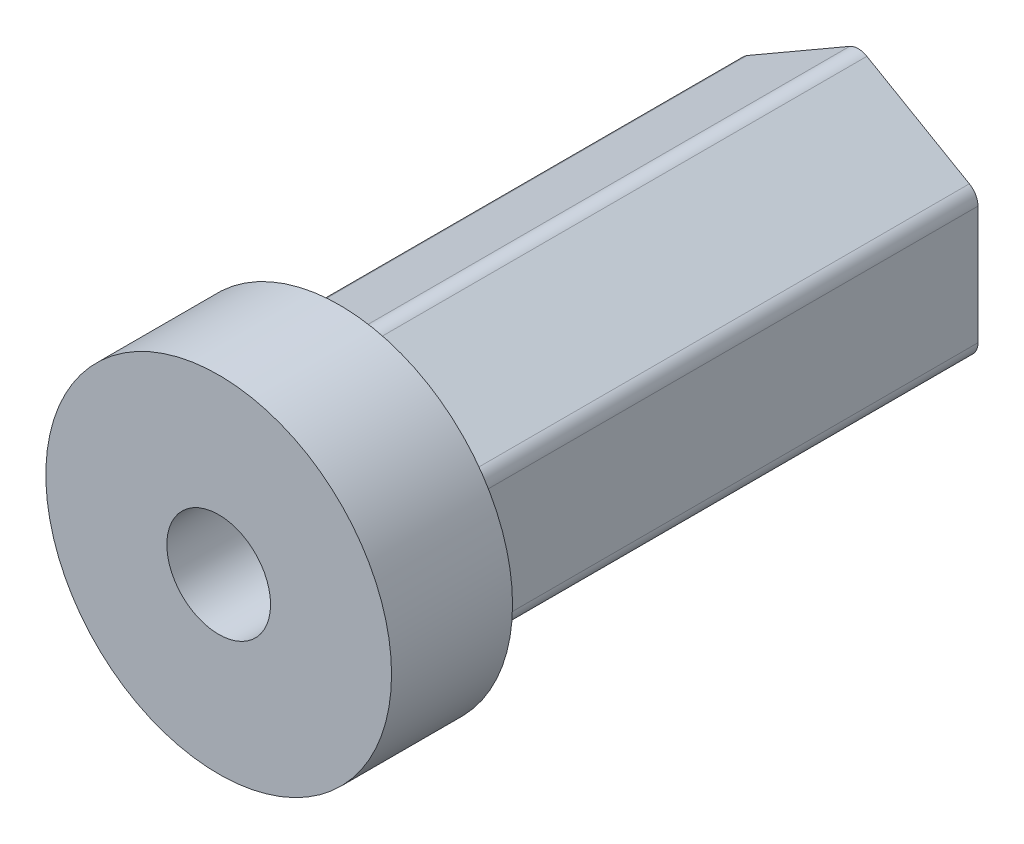
ISO-10303-21;
HEADER;
FILE_DESCRIPTION(('STEP AP214'),'2;1');
FILE_NAME('part.step','',(''),(''),'','','');
FILE_SCHEMA(('AUTOMOTIVE_DESIGN { 1 0 10303 214 1 1 1 1 }'));
ENDSEC;
DATA;
#1=APPLICATION_CONTEXT('core data for automotive mechanical design processes');
#2=APPLICATION_PROTOCOL_DEFINITION('international standard','automotive_design',2000,#1);
#3=PRODUCT_CONTEXT('',#1,'mechanical');
#4=PRODUCT('Part','Part','',(#3));
#5=PRODUCT_RELATED_PRODUCT_CATEGORY('part','',(#4));
#6=PRODUCT_DEFINITION_FORMATION('','',#4);
#7=PRODUCT_DEFINITION_CONTEXT('part definition',#1,'design');
#8=PRODUCT_DEFINITION('design','',#6,#7);
#9=PRODUCT_DEFINITION_SHAPE('','',#8);
#10=(LENGTH_UNIT() NAMED_UNIT(*) SI_UNIT(.MILLI.,.METRE.));
#11=(NAMED_UNIT(*) PLANE_ANGLE_UNIT() SI_UNIT($,.RADIAN.));
#12=(NAMED_UNIT(*) SI_UNIT($,.STERADIAN.) SOLID_ANGLE_UNIT());
#13=UNCERTAINTY_MEASURE_WITH_UNIT(LENGTH_MEASURE(1.E-05),#10,'distance_accuracy_value','');
#14=(GEOMETRIC_REPRESENTATION_CONTEXT(3) GLOBAL_UNCERTAINTY_ASSIGNED_CONTEXT((#13)) GLOBAL_UNIT_ASSIGNED_CONTEXT((#10,
#11,#12)) REPRESENTATION_CONTEXT('',''));
#15=CARTESIAN_POINT('',(0.,0.,0.));
#16=DIRECTION('',(0.,0.,1.));
#17=DIRECTION('',(1.,0.,0.));
#18=AXIS2_PLACEMENT_3D('',#15,#16,#17);
#19=CARTESIAN_POINT('',(0.,3.,-25.));
#20=DIRECTION('',(0.,0.,1.));
#21=DIRECTION('',(1.,0.,0.));
#22=AXIS2_PLACEMENT_3D('',#19,#20,#21);
#23=PLANE('',#22);
#24=CARTESIAN_POINT('',(0.,0.,-25.));
#25=DIRECTION('',(0.,0.,1.));
#26=DIRECTION('',(1.,0.,0.));
#27=AXIS2_PLACEMENT_3D('',#24,#25,#26);
#28=CIRCLE('',#27,3.);
#29=CARTESIAN_POINT('',(3.,0.,-25.));
#30=VERTEX_POINT('',#29);
#31=EDGE_CURVE('E177',#30,#30,#28,.T.);
#32=ORIENTED_EDGE('',*,*,#31,.T.);
#33=EDGE_LOOP('',(#32));
#34=FACE_BOUND('',#33,.T.);
#35=DIRECTION('',(0.,1.,0.));
#36=VECTOR('',#35,1.);
#37=CARTESIAN_POINT('',(-6.92820323027551,0.,-25.));
#38=LINE('',#37,#36);
#39=CARTESIAN_POINT('',(-6.92820323027551,-3.42264973081037,-25.));
#40=VERTEX_POINT('',#39);
#41=CARTESIAN_POINT('',(-6.9282032302755,3.42264973081038,-25.));
#42=VERTEX_POINT('',#41);
#43=EDGE_CURVE('E148',#40,#42,#38,.T.);
#44=ORIENTED_EDGE('',*,*,#43,.T.);
#45=CARTESIAN_POINT('',(-5.9282032302755,3.42264973081038,-25.));
#46=DIRECTION('',(0.,0.,1.));
#47=DIRECTION('',(1.,0.,0.));
#48=AXIS2_PLACEMENT_3D('',#45,#46,#47);
#49=CIRCLE('',#48,1.);
#50=CARTESIAN_POINT('',(-6.4282032302755,4.28867513459482,-25.));
#51=VERTEX_POINT('',#50);
#52=EDGE_CURVE('E155',#42,#51,#49,.F.);
#53=ORIENTED_EDGE('',*,*,#52,.T.);
#54=DIRECTION('',(0.86602540378444,0.499999999999998,0.));
#55=VECTOR('',#54,1.);
#56=CARTESIAN_POINT('',(-3.46410161513774,6.,-25.));
#57=LINE('',#56,#55);
#58=CARTESIAN_POINT('',(-0.499999999999981,7.71132486540519,-25.));
#59=VERTEX_POINT('',#58);
#60=EDGE_CURVE('E313',#51,#59,#57,.T.);
#61=ORIENTED_EDGE('',*,*,#60,.T.);
#62=CARTESIAN_POINT('',(0.,6.84529946162075,-25.));
#63=DIRECTION('',(0.,0.,1.));
#64=DIRECTION('',(1.,0.,0.));
#65=AXIS2_PLACEMENT_3D('',#62,#63,#64);
#66=CIRCLE('',#65,1.);
#67=CARTESIAN_POINT('',(0.500000000000017,7.71132486540518,-25.));
#68=VERTEX_POINT('',#67);
#69=EDGE_CURVE('E174',#59,#68,#66,.F.);
#70=ORIENTED_EDGE('',*,*,#69,.T.);
#71=DIRECTION('',(0.866025403784438,-0.500000000000002,0.));
#72=VECTOR('',#71,1.);
#73=CARTESIAN_POINT('',(3.46410161513777,5.99999999999999,-25.));
#74=LINE('',#73,#72);
#75=CARTESIAN_POINT('',(6.42820323027551,4.2886751345948,-25.));
#76=VERTEX_POINT('',#75);
#77=EDGE_CURVE('E232',#68,#76,#74,.T.);
#78=ORIENTED_EDGE('',*,*,#77,.T.);
#79=CARTESIAN_POINT('',(5.92820323027551,3.42264973081036,-25.));
#80=DIRECTION('',(0.,0.,1.));
#81=DIRECTION('',(1.,0.,0.));
#82=AXIS2_PLACEMENT_3D('',#79,#80,#81);
#83=CIRCLE('',#82,1.);
#84=CARTESIAN_POINT('',(6.92820323027551,3.42264973081036,-25.));
#85=VERTEX_POINT('',#84);
#86=EDGE_CURVE('E182',#76,#85,#83,.F.);
#87=ORIENTED_EDGE('',*,*,#86,.T.);
#88=DIRECTION('',(0.,-1.,0.));
#89=VECTOR('',#88,1.);
#90=CARTESIAN_POINT('',(6.92820323027551,0.,-25.));
#91=LINE('',#90,#89);
#92=CARTESIAN_POINT('',(6.9282032302755,-3.42264973081039,-25.));
#93=VERTEX_POINT('',#92);
#94=EDGE_CURVE('E233',#85,#93,#91,.T.);
#95=ORIENTED_EDGE('',*,*,#94,.T.);
#96=CARTESIAN_POINT('',(5.9282032302755,-3.42264973081039,-25.));
#97=DIRECTION('',(0.,0.,1.));
#98=DIRECTION('',(1.,0.,0.));
#99=AXIS2_PLACEMENT_3D('',#96,#97,#98);
#100=CIRCLE('',#99,1.);
#101=CARTESIAN_POINT('',(6.4282032302755,-4.28867513459483,-25.));
#102=VERTEX_POINT('',#101);
#103=EDGE_CURVE('E184',#93,#102,#100,.F.);
#104=ORIENTED_EDGE('',*,*,#103,.T.);
#105=DIRECTION('',(-0.86602540378444,-0.499999999999998,0.));
#106=VECTOR('',#105,1.);
#107=CARTESIAN_POINT('',(3.46410161513774,-6.00000000000001,-25.));
#108=LINE('',#107,#106);
#109=CARTESIAN_POINT('',(0.499999999999984,-7.71132486540519,-25.));
#110=VERTEX_POINT('',#109);
#111=EDGE_CURVE('E238',#102,#110,#108,.T.);
#112=ORIENTED_EDGE('',*,*,#111,.T.);
#113=CARTESIAN_POINT('',(0.,-6.84529946162075,-25.));
#114=DIRECTION('',(0.,0.,1.));
#115=DIRECTION('',(1.,0.,0.));
#116=AXIS2_PLACEMENT_3D('',#113,#114,#115);
#117=CIRCLE('',#116,1.);
#118=CARTESIAN_POINT('',(-0.500000000000015,-7.71132486540519,-25.));
#119=VERTEX_POINT('',#118);
#120=EDGE_CURVE('E156',#110,#119,#117,.F.);
#121=ORIENTED_EDGE('',*,*,#120,.T.);
#122=DIRECTION('',(-0.866025403784438,0.500000000000001,0.));
#123=VECTOR('',#122,1.);
#124=CARTESIAN_POINT('',(-3.46410161513777,-6.,-25.));
#125=LINE('',#124,#123);
#126=CARTESIAN_POINT('',(-6.42820323027551,-4.2886751345948,-25.));
#127=VERTEX_POINT('',#126);
#128=EDGE_CURVE('E150',#119,#127,#125,.T.);
#129=ORIENTED_EDGE('',*,*,#128,.T.);
#130=CARTESIAN_POINT('',(-5.92820323027551,-3.42264973081037,-25.));
#131=DIRECTION('',(0.,0.,1.));
#132=DIRECTION('',(1.,0.,0.));
#133=AXIS2_PLACEMENT_3D('',#130,#131,#132);
#134=CIRCLE('',#133,1.);
#135=EDGE_CURVE('E146',#127,#40,#134,.F.);
#136=ORIENTED_EDGE('',*,*,#135,.T.);
#137=EDGE_LOOP('',(#44,#53,#61,#70,#78,#87,#95,#104,#112,#121,#129,#136));
#138=FACE_BOUND('',#137,.T.);
#139=ADVANCED_FACE('F57',(#34,#138),#23,.F.);
#140=CARTESIAN_POINT('',(0.,10.,12.));
#141=DIRECTION('',(0.,0.,-1.));
#142=DIRECTION('',(-1.,0.,0.));
#143=AXIS2_PLACEMENT_3D('',#140,#141,#142);
#144=PLANE('',#143);
#145=CARTESIAN_POINT('',(0.,0.,12.));
#146=DIRECTION('',(0.,0.,1.));
#147=DIRECTION('',(1.,0.,0.));
#148=AXIS2_PLACEMENT_3D('',#145,#146,#147);
#149=CIRCLE('',#148,3.);
#150=CARTESIAN_POINT('',(3.,0.,12.));
#151=VERTEX_POINT('',#150);
#152=EDGE_CURVE('E172',#151,#151,#149,.T.);
#153=ORIENTED_EDGE('',*,*,#152,.F.);
#154=EDGE_LOOP('',(#153));
#155=FACE_BOUND('',#154,.T.);
#156=CARTESIAN_POINT('',(0.,0.,12.));
#157=DIRECTION('',(0.,0.,1.));
#158=DIRECTION('',(1.,0.,0.));
#159=AXIS2_PLACEMENT_3D('',#156,#157,#158);
#160=CIRCLE('',#159,10.);
#161=CARTESIAN_POINT('',(10.,0.,12.));
#162=VERTEX_POINT('',#161);
#163=EDGE_CURVE('E252',#162,#162,#160,.T.);
#164=ORIENTED_EDGE('',*,*,#163,.T.);
#165=EDGE_LOOP('',(#164));
#166=FACE_BOUND('',#165,.T.);
#167=ADVANCED_FACE('F266',(#155,#166),#144,.F.);
#168=CARTESIAN_POINT('',(0.,0.,0.));
#169=DIRECTION('',(0.,0.,1.));
#170=DIRECTION('',(1.,0.,0.));
#171=AXIS2_PLACEMENT_3D('',#168,#169,#170);
#172=CYLINDRICAL_SURFACE('',#171,3.);
#173=ORIENTED_EDGE('',*,*,#31,.F.);
#174=EDGE_LOOP('',(#173));
#175=FACE_BOUND('',#174,.T.);
#176=ORIENTED_EDGE('',*,*,#152,.T.);
#177=EDGE_LOOP('',(#176));
#178=FACE_BOUND('',#177,.T.);
#179=ADVANCED_FACE('F263',(#175,#178),#172,.F.);
#180=CARTESIAN_POINT('',(0.,8.,5.));
#181=DIRECTION('',(0.,0.,1.));
#182=DIRECTION('',(1.,0.,0.));
#183=AXIS2_PLACEMENT_3D('',#180,#181,#182);
#184=PLANE('',#183);
#185=CARTESIAN_POINT('',(0.,0.,5.));
#186=DIRECTION('',(0.,0.,1.));
#187=DIRECTION('',(1.,0.,0.));
#188=AXIS2_PLACEMENT_3D('',#185,#186,#187);
#189=CIRCLE('',#188,10.);
#190=CARTESIAN_POINT('',(10.,0.,5.));
#191=VERTEX_POINT('',#190);
#192=EDGE_CURVE('E257',#191,#191,#189,.T.);
#193=ORIENTED_EDGE('',*,*,#192,.F.);
#194=EDGE_LOOP('',(#193));
#195=FACE_BOUND('',#194,.T.);
#196=DIRECTION('',(0.866025403784438,-0.500000000000002,0.));
#197=VECTOR('',#196,1.);
#198=CARTESIAN_POINT('',(3.46410161513777,5.99999999999999,5.));
#199=LINE('',#198,#197);
#200=CARTESIAN_POINT('',(0.500000000000017,7.71132486540518,5.));
#201=VERTEX_POINT('',#200);
#202=CARTESIAN_POINT('',(6.42820323027551,4.2886751345948,5.));
#203=VERTEX_POINT('',#202);
#204=EDGE_CURVE('E250',#201,#203,#199,.T.);
#205=ORIENTED_EDGE('',*,*,#204,.F.);
#206=CARTESIAN_POINT('',(0.,6.84529946162075,5.));
#207=DIRECTION('',(0.,0.,1.));
#208=DIRECTION('',(1.,0.,0.));
#209=AXIS2_PLACEMENT_3D('',#206,#207,#208);
#210=CIRCLE('',#209,1.);
#211=CARTESIAN_POINT('',(-0.499999999999981,7.71132486540519,5.));
#212=VERTEX_POINT('',#211);
#213=EDGE_CURVE('E12',#201,#212,#210,.T.);
#214=ORIENTED_EDGE('',*,*,#213,.T.);
#215=DIRECTION('',(0.86602540378444,0.499999999999998,0.));
#216=VECTOR('',#215,1.);
#217=CARTESIAN_POINT('',(-3.46410161513774,6.,5.));
#218=LINE('',#217,#216);
#219=CARTESIAN_POINT('',(-6.4282032302755,4.28867513459482,5.));
#220=VERTEX_POINT('',#219);
#221=EDGE_CURVE('E167',#220,#212,#218,.T.);
#222=ORIENTED_EDGE('',*,*,#221,.F.);
#223=CARTESIAN_POINT('',(-5.9282032302755,3.42264973081038,5.));
#224=DIRECTION('',(0.,0.,1.));
#225=DIRECTION('',(1.,0.,0.));
#226=AXIS2_PLACEMENT_3D('',#223,#224,#225);
#227=CIRCLE('',#226,1.);
#228=CARTESIAN_POINT('',(-6.9282032302755,3.42264973081038,5.));
#229=VERTEX_POINT('',#228);
#230=EDGE_CURVE('E211',#220,#229,#227,.T.);
#231=ORIENTED_EDGE('',*,*,#230,.T.);
#232=DIRECTION('',(0.,1.,0.));
#233=VECTOR('',#232,1.);
#234=CARTESIAN_POINT('',(-6.92820323027551,0.,5.));
#235=LINE('',#234,#233);
#236=CARTESIAN_POINT('',(-6.92820323027551,-3.42264973081037,5.));
#237=VERTEX_POINT('',#236);
#238=EDGE_CURVE('E166',#237,#229,#235,.T.);
#239=ORIENTED_EDGE('',*,*,#238,.F.);
#240=CARTESIAN_POINT('',(-5.92820323027551,-3.42264973081037,5.));
#241=DIRECTION('',(0.,0.,1.));
#242=DIRECTION('',(1.,0.,0.));
#243=AXIS2_PLACEMENT_3D('',#240,#241,#242);
#244=CIRCLE('',#243,1.);
#245=CARTESIAN_POINT('',(-6.42820323027551,-4.2886751345948,5.));
#246=VERTEX_POINT('',#245);
#247=EDGE_CURVE('E171',#237,#246,#244,.T.);
#248=ORIENTED_EDGE('',*,*,#247,.T.);
#249=DIRECTION('',(-0.866025403784438,0.500000000000001,0.));
#250=VECTOR('',#249,1.);
#251=CARTESIAN_POINT('',(-3.46410161513777,-6.,5.));
#252=LINE('',#251,#250);
#253=CARTESIAN_POINT('',(-0.500000000000015,-7.71132486540519,5.));
#254=VERTEX_POINT('',#253);
#255=EDGE_CURVE('E242',#254,#246,#252,.T.);
#256=ORIENTED_EDGE('',*,*,#255,.F.);
#257=CARTESIAN_POINT('',(0.,-6.84529946162075,5.));
#258=DIRECTION('',(0.,0.,1.));
#259=DIRECTION('',(1.,0.,0.));
#260=AXIS2_PLACEMENT_3D('',#257,#258,#259);
#261=CIRCLE('',#260,1.);
#262=CARTESIAN_POINT('',(0.499999999999984,-7.71132486540519,5.));
#263=VERTEX_POINT('',#262);
#264=EDGE_CURVE('E214',#254,#263,#261,.T.);
#265=ORIENTED_EDGE('',*,*,#264,.T.);
#266=DIRECTION('',(-0.86602540378444,-0.499999999999998,0.));
#267=VECTOR('',#266,1.);
#268=CARTESIAN_POINT('',(3.46410161513774,-6.00000000000001,5.));
#269=LINE('',#268,#267);
#270=CARTESIAN_POINT('',(6.4282032302755,-4.28867513459483,5.));
#271=VERTEX_POINT('',#270);
#272=EDGE_CURVE('E223',#271,#263,#269,.T.);
#273=ORIENTED_EDGE('',*,*,#272,.F.);
#274=CARTESIAN_POINT('',(5.9282032302755,-3.42264973081039,5.));
#275=DIRECTION('',(0.,0.,1.));
#276=DIRECTION('',(1.,0.,0.));
#277=AXIS2_PLACEMENT_3D('',#274,#275,#276);
#278=CIRCLE('',#277,1.);
#279=CARTESIAN_POINT('',(6.9282032302755,-3.42264973081039,5.));
#280=VERTEX_POINT('',#279);
#281=EDGE_CURVE('E216',#271,#280,#278,.T.);
#282=ORIENTED_EDGE('',*,*,#281,.T.);
#283=DIRECTION('',(0.,-1.,0.));
#284=VECTOR('',#283,1.);
#285=CARTESIAN_POINT('',(6.92820323027551,0.,5.));
#286=LINE('',#285,#284);
#287=CARTESIAN_POINT('',(6.92820323027551,3.42264973081036,5.));
#288=VERTEX_POINT('',#287);
#289=EDGE_CURVE('E221',#288,#280,#286,.T.);
#290=ORIENTED_EDGE('',*,*,#289,.F.);
#291=CARTESIAN_POINT('',(5.92820323027551,3.42264973081036,5.));
#292=DIRECTION('',(0.,0.,1.));
#293=DIRECTION('',(1.,0.,0.));
#294=AXIS2_PLACEMENT_3D('',#291,#292,#293);
#295=CIRCLE('',#294,1.);
#296=EDGE_CURVE('E65',#288,#203,#295,.T.);
#297=ORIENTED_EDGE('',*,*,#296,.T.);
#298=EDGE_LOOP('',(#205,#214,#222,#231,#239,#248,#256,#265,#273,#282,#290,#297));
#299=FACE_BOUND('',#298,.T.);
#300=ADVANCED_FACE('F220',(#195,#299),#184,.F.);
#301=CARTESIAN_POINT('',(0.,0.,0.));
#302=DIRECTION('',(0.,0.,1.));
#303=DIRECTION('',(1.,0.,0.));
#304=AXIS2_PLACEMENT_3D('',#301,#302,#303);
#305=CYLINDRICAL_SURFACE('',#304,10.);
#306=ORIENTED_EDGE('',*,*,#163,.F.);
#307=EDGE_LOOP('',(#306));
#308=FACE_BOUND('',#307,.T.);
#309=ORIENTED_EDGE('',*,*,#192,.T.);
#310=EDGE_LOOP('',(#309));
#311=FACE_BOUND('',#310,.T.);
#312=ADVANCED_FACE('F275',(#308,#311),#305,.T.);
#313=CARTESIAN_POINT('',(3.46410161513777,5.99999999999999,5.));
#314=DIRECTION('',(0.500000000000002,0.866025403784438,0.));
#315=DIRECTION('',(-0.866025403784438,0.500000000000002,0.));
#316=AXIS2_PLACEMENT_3D('',#313,#314,#315);
#317=PLANE('',#316);
#318=ORIENTED_EDGE('',*,*,#204,.T.);
#319=DIRECTION('',(0.,0.,-1.));
#320=VECTOR('',#319,1.);
#321=CARTESIAN_POINT('',(6.42820323027551,4.2886751345948,5.));
#322=LINE('',#321,#320);
#323=EDGE_CURVE('E208',#203,#76,#322,.T.);
#324=ORIENTED_EDGE('',*,*,#323,.T.);
#325=ORIENTED_EDGE('',*,*,#77,.F.);
#326=DIRECTION('',(0.,0.,-1.));
#327=VECTOR('',#326,1.);
#328=CARTESIAN_POINT('',(0.500000000000017,7.71132486540518,5.));
#329=LINE('',#328,#327);
#330=EDGE_CURVE('E78',#68,#201,#329,.F.);
#331=ORIENTED_EDGE('',*,*,#330,.T.);
#332=EDGE_LOOP('',(#318,#324,#325,#331));
#333=FACE_BOUND('',#332,.T.);
#334=ADVANCED_FACE('F278',(#333),#317,.T.);
#335=CARTESIAN_POINT('',(6.92820323027551,0.,5.));
#336=DIRECTION('',(1.,0.,0.));
#337=DIRECTION('',(0.,1.,0.));
#338=AXIS2_PLACEMENT_3D('',#335,#336,#337);
#339=PLANE('',#338);
#340=ORIENTED_EDGE('',*,*,#289,.T.);
#341=DIRECTION('',(0.,0.,-1.));
#342=VECTOR('',#341,1.);
#343=CARTESIAN_POINT('',(6.9282032302755,-3.42264973081039,5.));
#344=LINE('',#343,#342);
#345=EDGE_CURVE('E204',#280,#93,#344,.T.);
#346=ORIENTED_EDGE('',*,*,#345,.T.);
#347=ORIENTED_EDGE('',*,*,#94,.F.);
#348=DIRECTION('',(0.,0.,-1.));
#349=VECTOR('',#348,1.);
#350=CARTESIAN_POINT('',(6.92820323027551,3.42264973081036,5.));
#351=LINE('',#350,#349);
#352=EDGE_CURVE('E202',#85,#288,#351,.F.);
#353=ORIENTED_EDGE('',*,*,#352,.T.);
#354=EDGE_LOOP('',(#340,#346,#347,#353));
#355=FACE_BOUND('',#354,.T.);
#356=ADVANCED_FACE('F228',(#355),#339,.T.);
#357=CARTESIAN_POINT('',(3.46410161513774,-6.00000000000001,5.));
#358=DIRECTION('',(0.499999999999998,-0.86602540378444,0.));
#359=DIRECTION('',(0.86602540378444,0.499999999999998,0.));
#360=AXIS2_PLACEMENT_3D('',#357,#358,#359);
#361=PLANE('',#360);
#362=ORIENTED_EDGE('',*,*,#272,.T.);
#363=DIRECTION('',(0.,0.,-1.));
#364=VECTOR('',#363,1.);
#365=CARTESIAN_POINT('',(0.499999999999984,-7.71132486540519,5.));
#366=LINE('',#365,#364);
#367=EDGE_CURVE('E199',#263,#110,#366,.T.);
#368=ORIENTED_EDGE('',*,*,#367,.T.);
#369=ORIENTED_EDGE('',*,*,#111,.F.);
#370=DIRECTION('',(0.,0.,-1.));
#371=VECTOR('',#370,1.);
#372=CARTESIAN_POINT('',(6.4282032302755,-4.28867513459483,5.));
#373=LINE('',#372,#371);
#374=EDGE_CURVE('E197',#102,#271,#373,.F.);
#375=ORIENTED_EDGE('',*,*,#374,.T.);
#376=EDGE_LOOP('',(#362,#368,#369,#375));
#377=FACE_BOUND('',#376,.T.);
#378=ADVANCED_FACE('F240',(#377),#361,.T.);
#379=CARTESIAN_POINT('',(-3.46410161513777,-6.,5.));
#380=DIRECTION('',(-0.500000000000001,-0.866025403784438,0.));
#381=DIRECTION('',(0.866025403784438,-0.500000000000001,0.));
#382=AXIS2_PLACEMENT_3D('',#379,#380,#381);
#383=PLANE('',#382);
#384=ORIENTED_EDGE('',*,*,#255,.T.);
#385=DIRECTION('',(0.,0.,-1.));
#386=VECTOR('',#385,1.);
#387=CARTESIAN_POINT('',(-6.42820323027551,-4.28867513459481,5.));
#388=LINE('',#387,#386);
#389=EDGE_CURVE('E195',#246,#127,#388,.T.);
#390=ORIENTED_EDGE('',*,*,#389,.T.);
#391=ORIENTED_EDGE('',*,*,#128,.F.);
#392=DIRECTION('',(0.,0.,-1.));
#393=VECTOR('',#392,1.);
#394=CARTESIAN_POINT('',(-0.500000000000015,-7.71132486540519,5.));
#395=LINE('',#394,#393);
#396=EDGE_CURVE('E193',#119,#254,#395,.F.);
#397=ORIENTED_EDGE('',*,*,#396,.T.);
#398=EDGE_LOOP('',(#384,#390,#391,#397));
#399=FACE_BOUND('',#398,.T.);
#400=ADVANCED_FACE('F327',(#399),#383,.T.);
#401=CARTESIAN_POINT('',(-6.92820323027551,0.,5.));
#402=DIRECTION('',(-1.,0.,0.));
#403=DIRECTION('',(0.,-1.,0.));
#404=AXIS2_PLACEMENT_3D('',#401,#402,#403);
#405=PLANE('',#404);
#406=ORIENTED_EDGE('',*,*,#238,.T.);
#407=DIRECTION('',(0.,0.,-1.));
#408=VECTOR('',#407,1.);
#409=CARTESIAN_POINT('',(-6.9282032302755,3.42264973081038,5.));
#410=LINE('',#409,#408);
#411=EDGE_CURVE('E165',#229,#42,#410,.T.);
#412=ORIENTED_EDGE('',*,*,#411,.T.);
#413=ORIENTED_EDGE('',*,*,#43,.F.);
#414=DIRECTION('',(0.,0.,-1.));
#415=VECTOR('',#414,1.);
#416=CARTESIAN_POINT('',(-6.92820323027551,-3.42264973081037,5.));
#417=LINE('',#416,#415);
#418=EDGE_CURVE('E162',#40,#237,#417,.F.);
#419=ORIENTED_EDGE('',*,*,#418,.T.);
#420=EDGE_LOOP('',(#406,#412,#413,#419));
#421=FACE_BOUND('',#420,.T.);
#422=ADVANCED_FACE('F161',(#421),#405,.T.);
#423=CARTESIAN_POINT('',(-3.46410161513774,6.,5.));
#424=DIRECTION('',(-0.499999999999998,0.86602540378444,0.));
#425=DIRECTION('',(-0.86602540378444,-0.499999999999998,0.));
#426=AXIS2_PLACEMENT_3D('',#423,#424,#425);
#427=PLANE('',#426);
#428=ORIENTED_EDGE('',*,*,#60,.F.);
#429=DIRECTION('',(0.,0.,-1.));
#430=VECTOR('',#429,1.);
#431=CARTESIAN_POINT('',(-6.4282032302755,4.28867513459482,5.));
#432=LINE('',#431,#430);
#433=EDGE_CURVE('E191',#51,#220,#432,.F.);
#434=ORIENTED_EDGE('',*,*,#433,.T.);
#435=ORIENTED_EDGE('',*,*,#221,.T.);
#436=DIRECTION('',(0.,0.,-1.));
#437=VECTOR('',#436,1.);
#438=CARTESIAN_POINT('',(-0.499999999999983,7.71132486540519,5.));
#439=LINE('',#438,#437);
#440=EDGE_CURVE('E188',#212,#59,#439,.T.);
#441=ORIENTED_EDGE('',*,*,#440,.T.);
#442=EDGE_LOOP('',(#428,#434,#435,#441));
#443=FACE_BOUND('',#442,.T.);
#444=ADVANCED_FACE('F294',(#443),#427,.T.);
#445=CARTESIAN_POINT('',(-5.9282032302755,3.42264973081038,5.));
#446=DIRECTION('',(0.,0.,-1.));
#447=DIRECTION('',(-1.,0.,0.));
#448=AXIS2_PLACEMENT_3D('',#445,#446,#447);
#449=CYLINDRICAL_SURFACE('',#448,1.);
#450=ORIENTED_EDGE('',*,*,#230,.F.);
#451=ORIENTED_EDGE('',*,*,#433,.F.);
#452=ORIENTED_EDGE('',*,*,#52,.F.);
#453=ORIENTED_EDGE('',*,*,#411,.F.);
#454=EDGE_LOOP('',(#450,#451,#452,#453));
#455=FACE_BOUND('',#454,.T.);
#456=ADVANCED_FACE('F291',(#455),#449,.T.);
#457=CARTESIAN_POINT('',(-5.92820323027551,-3.42264973081037,5.));
#458=DIRECTION('',(0.,0.,-1.));
#459=DIRECTION('',(-1.,0.,0.));
#460=AXIS2_PLACEMENT_3D('',#457,#458,#459);
#461=CYLINDRICAL_SURFACE('',#460,1.);
#462=ORIENTED_EDGE('',*,*,#247,.F.);
#463=ORIENTED_EDGE('',*,*,#418,.F.);
#464=ORIENTED_EDGE('',*,*,#135,.F.);
#465=ORIENTED_EDGE('',*,*,#389,.F.);
#466=EDGE_LOOP('',(#462,#463,#464,#465));
#467=FACE_BOUND('',#466,.T.);
#468=ADVANCED_FACE('F170',(#467),#461,.T.);
#469=CARTESIAN_POINT('',(0.,-6.84529946162075,5.));
#470=DIRECTION('',(0.,0.,-1.));
#471=DIRECTION('',(-1.,0.,0.));
#472=AXIS2_PLACEMENT_3D('',#469,#470,#471);
#473=CYLINDRICAL_SURFACE('',#472,1.);
#474=ORIENTED_EDGE('',*,*,#264,.F.);
#475=ORIENTED_EDGE('',*,*,#396,.F.);
#476=ORIENTED_EDGE('',*,*,#120,.F.);
#477=ORIENTED_EDGE('',*,*,#367,.F.);
#478=EDGE_LOOP('',(#474,#475,#476,#477));
#479=FACE_BOUND('',#478,.T.);
#480=ADVANCED_FACE('F298',(#479),#473,.T.);
#481=CARTESIAN_POINT('',(5.9282032302755,-3.42264973081039,5.));
#482=DIRECTION('',(0.,0.,-1.));
#483=DIRECTION('',(-1.,0.,0.));
#484=AXIS2_PLACEMENT_3D('',#481,#482,#483);
#485=CYLINDRICAL_SURFACE('',#484,1.);
#486=ORIENTED_EDGE('',*,*,#281,.F.);
#487=ORIENTED_EDGE('',*,*,#374,.F.);
#488=ORIENTED_EDGE('',*,*,#103,.F.);
#489=ORIENTED_EDGE('',*,*,#345,.F.);
#490=EDGE_LOOP('',(#486,#487,#488,#489));
#491=FACE_BOUND('',#490,.T.);
#492=ADVANCED_FACE('F235',(#491),#485,.T.);
#493=CARTESIAN_POINT('',(5.92820323027551,3.42264973081036,5.));
#494=DIRECTION('',(0.,0.,-1.));
#495=DIRECTION('',(-1.,0.,0.));
#496=AXIS2_PLACEMENT_3D('',#493,#494,#495);
#497=CYLINDRICAL_SURFACE('',#496,1.);
#498=ORIENTED_EDGE('',*,*,#296,.F.);
#499=ORIENTED_EDGE('',*,*,#352,.F.);
#500=ORIENTED_EDGE('',*,*,#86,.F.);
#501=ORIENTED_EDGE('',*,*,#323,.F.);
#502=EDGE_LOOP('',(#498,#499,#500,#501));
#503=FACE_BOUND('',#502,.T.);
#504=ADVANCED_FACE('F303',(#503),#497,.T.);
#505=CARTESIAN_POINT('',(0.,6.84529946162075,5.));
#506=DIRECTION('',(0.,0.,-1.));
#507=DIRECTION('',(-1.,0.,0.));
#508=AXIS2_PLACEMENT_3D('',#505,#506,#507);
#509=CYLINDRICAL_SURFACE('',#508,1.);
#510=ORIENTED_EDGE('',*,*,#213,.F.);
#511=ORIENTED_EDGE('',*,*,#330,.F.);
#512=ORIENTED_EDGE('',*,*,#69,.F.);
#513=ORIENTED_EDGE('',*,*,#440,.F.);
#514=EDGE_LOOP('',(#510,#511,#512,#513));
#515=FACE_BOUND('',#514,.T.);
#516=ADVANCED_FACE('F59',(#515),#509,.T.);
#517=CLOSED_SHELL('',(#139,#167,#179,#300,#312,#334,#356,#378,#400,#422,#444,#456,#468,#480,
#492,#504,#516));
#518=MANIFOLD_SOLID_BREP('B2',#517);
#519=ADVANCED_BREP_SHAPE_REPRESENTATION('',(#18,#518),#14);
#520=SHAPE_DEFINITION_REPRESENTATION(#9,#519);
ENDSEC;
END-ISO-10303-21;
